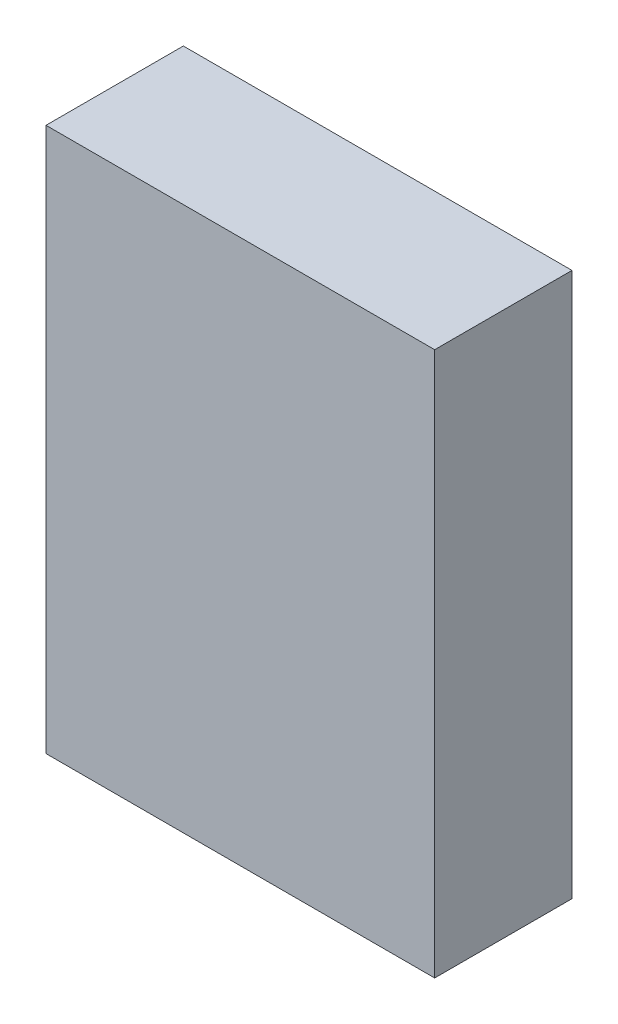
ISO-10303-21;
HEADER;
FILE_DESCRIPTION(('STEP AP214'),'2;1');
FILE_NAME('part.step','',(''),(''),'','','');
FILE_SCHEMA(('AUTOMOTIVE_DESIGN { 1 0 10303 214 1 1 1 1 }'));
ENDSEC;
DATA;
#1=APPLICATION_CONTEXT('core data for automotive mechanical design processes');
#2=APPLICATION_PROTOCOL_DEFINITION('international standard','automotive_design',2000,#1);
#3=PRODUCT_CONTEXT('',#1,'mechanical');
#4=PRODUCT('Part','Part','',(#3));
#5=PRODUCT_RELATED_PRODUCT_CATEGORY('part','',(#4));
#6=PRODUCT_DEFINITION_FORMATION('','',#4);
#7=PRODUCT_DEFINITION_CONTEXT('part definition',#1,'design');
#8=PRODUCT_DEFINITION('design','',#6,#7);
#9=PRODUCT_DEFINITION_SHAPE('','',#8);
#10=(LENGTH_UNIT() NAMED_UNIT(*) SI_UNIT(.MILLI.,.METRE.));
#11=(NAMED_UNIT(*) PLANE_ANGLE_UNIT() SI_UNIT($,.RADIAN.));
#12=(NAMED_UNIT(*) SI_UNIT($,.STERADIAN.) SOLID_ANGLE_UNIT());
#13=UNCERTAINTY_MEASURE_WITH_UNIT(LENGTH_MEASURE(1.E-05),#10,'distance_accuracy_value','');
#14=(GEOMETRIC_REPRESENTATION_CONTEXT(3) GLOBAL_UNCERTAINTY_ASSIGNED_CONTEXT((#13)) GLOBAL_UNIT_ASSIGNED_CONTEXT((#10,
#11,#12)) REPRESENTATION_CONTEXT('',''));
#15=CARTESIAN_POINT('',(0.,0.,0.));
#16=DIRECTION('',(0.,0.,1.));
#17=DIRECTION('',(1.,0.,0.));
#18=AXIS2_PLACEMENT_3D('',#15,#16,#17);
#19=CARTESIAN_POINT('',(-3.75000012,5.24999966,2.64999978));
#20=DIRECTION('',(0.,0.,1.));
#21=DIRECTION('',(1.,0.,0.));
#22=AXIS2_PLACEMENT_3D('',#19,#20,#21);
#23=PLANE('',#22);
#24=DIRECTION('',(0.,1.,0.));
#25=VECTOR('',#24,1.);
#26=CARTESIAN_POINT('',(3.75000012,5.24999966,2.64999978));
#27=LINE('',#26,#25);
#28=CARTESIAN_POINT('',(3.75000012,5.24999966,2.64999978));
#29=VERTEX_POINT('',#28);
#30=CARTESIAN_POINT('',(3.75000012,-5.24999966,2.64999978));
#31=VERTEX_POINT('',#30);
#32=EDGE_CURVE('E53',#29,#31,#27,.F.);
#33=ORIENTED_EDGE('',*,*,#32,.F.);
#34=DIRECTION('',(1.,0.,0.));
#35=VECTOR('',#34,1.);
#36=CARTESIAN_POINT('',(-3.75000012,5.24999966,2.64999978));
#37=LINE('',#36,#35);
#38=CARTESIAN_POINT('',(-3.75000012,5.24999966,2.64999978));
#39=VERTEX_POINT('',#38);
#40=EDGE_CURVE('E68',#39,#29,#37,.T.);
#41=ORIENTED_EDGE('',*,*,#40,.F.);
#42=DIRECTION('',(0.,1.,0.));
#43=VECTOR('',#42,1.);
#44=CARTESIAN_POINT('',(-3.75000012,-5.24999966,2.64999978));
#45=LINE('',#44,#43);
#46=CARTESIAN_POINT('',(-3.75000012,-5.24999966,2.64999978));
#47=VERTEX_POINT('',#46);
#48=EDGE_CURVE('E20',#47,#39,#45,.T.);
#49=ORIENTED_EDGE('',*,*,#48,.F.);
#50=DIRECTION('',(1.,0.,0.));
#51=VECTOR('',#50,1.);
#52=CARTESIAN_POINT('',(3.75000012,-5.24999966,2.64999978));
#53=LINE('',#52,#51);
#54=EDGE_CURVE('E58',#31,#47,#53,.F.);
#55=ORIENTED_EDGE('',*,*,#54,.F.);
#56=EDGE_LOOP('',(#33,#41,#49,#55));
#57=FACE_BOUND('',#56,.T.);
#58=ADVANCED_FACE('F17',(#57),#23,.T.);
#59=CARTESIAN_POINT('',(-3.75000012,-5.24999966,0.));
#60=DIRECTION('',(-1.,0.,0.));
#61=DIRECTION('',(0.,0.,1.));
#62=AXIS2_PLACEMENT_3D('',#59,#60,#61);
#63=PLANE('',#62);
#64=DIRECTION('',(0.,0.,1.));
#65=VECTOR('',#64,1.);
#66=CARTESIAN_POINT('',(-3.75000012,5.24999966,0.));
#67=LINE('',#66,#65);
#68=CARTESIAN_POINT('',(-3.75000012,5.24999966,0.));
#69=VERTEX_POINT('',#68);
#70=EDGE_CURVE('E79',#69,#39,#67,.T.);
#71=ORIENTED_EDGE('',*,*,#70,.F.);
#72=DIRECTION('',(0.,1.,0.));
#73=VECTOR('',#72,1.);
#74=CARTESIAN_POINT('',(-3.75000012,5.24999966,0.));
#75=LINE('',#74,#73);
#76=CARTESIAN_POINT('',(-3.75000012,-5.24999966,0.));
#77=VERTEX_POINT('',#76);
#78=EDGE_CURVE('E74',#69,#77,#75,.F.);
#79=ORIENTED_EDGE('',*,*,#78,.T.);
#80=DIRECTION('',(0.,0.,-1.));
#81=VECTOR('',#80,1.);
#82=CARTESIAN_POINT('',(-3.75000012,-5.24999966,0.));
#83=LINE('',#82,#81);
#84=EDGE_CURVE('E63',#47,#77,#83,.T.);
#85=ORIENTED_EDGE('',*,*,#84,.F.);
#86=ORIENTED_EDGE('',*,*,#48,.T.);
#87=EDGE_LOOP('',(#71,#79,#85,#86));
#88=FACE_BOUND('',#87,.T.);
#89=ADVANCED_FACE('F73',(#88),#63,.T.);
#90=CARTESIAN_POINT('',(3.75000012,-5.24999966,0.));
#91=DIRECTION('',(0.,-1.,0.));
#92=DIRECTION('',(0.,0.,-1.));
#93=AXIS2_PLACEMENT_3D('',#90,#91,#92);
#94=PLANE('',#93);
#95=ORIENTED_EDGE('',*,*,#84,.T.);
#96=DIRECTION('',(1.,0.,0.));
#97=VECTOR('',#96,1.);
#98=CARTESIAN_POINT('',(-3.75000012,-5.24999966,0.));
#99=LINE('',#98,#97);
#100=CARTESIAN_POINT('',(3.75000012,-5.24999966,0.));
#101=VERTEX_POINT('',#100);
#102=EDGE_CURVE('E84',#77,#101,#99,.T.);
#103=ORIENTED_EDGE('',*,*,#102,.T.);
#104=DIRECTION('',(0.,0.,-1.));
#105=VECTOR('',#104,1.);
#106=CARTESIAN_POINT('',(3.75000012,-5.24999966,0.));
#107=LINE('',#106,#105);
#108=EDGE_CURVE('E65',#31,#101,#107,.T.);
#109=ORIENTED_EDGE('',*,*,#108,.F.);
#110=ORIENTED_EDGE('',*,*,#54,.T.);
#111=EDGE_LOOP('',(#95,#103,#109,#110));
#112=FACE_BOUND('',#111,.T.);
#113=ADVANCED_FACE('F60',(#112),#94,.T.);
#114=CARTESIAN_POINT('',(3.75000012,5.24999966,0.));
#115=DIRECTION('',(1.,0.,0.));
#116=DIRECTION('',(0.,0.,-1.));
#117=AXIS2_PLACEMENT_3D('',#114,#115,#116);
#118=PLANE('',#117);
#119=ORIENTED_EDGE('',*,*,#108,.T.);
#120=DIRECTION('',(0.,1.,0.));
#121=VECTOR('',#120,1.);
#122=CARTESIAN_POINT('',(3.75000012,5.24999966,0.));
#123=LINE('',#122,#121);
#124=CARTESIAN_POINT('',(3.75000012,5.24999966,0.));
#125=VERTEX_POINT('',#124);
#126=EDGE_CURVE('E26',#101,#125,#123,.T.);
#127=ORIENTED_EDGE('',*,*,#126,.T.);
#128=DIRECTION('',(0.,0.,1.));
#129=VECTOR('',#128,1.);
#130=CARTESIAN_POINT('',(3.75000012,5.24999966,0.));
#131=LINE('',#130,#129);
#132=EDGE_CURVE('E34',#29,#125,#131,.F.);
#133=ORIENTED_EDGE('',*,*,#132,.F.);
#134=ORIENTED_EDGE('',*,*,#32,.T.);
#135=EDGE_LOOP('',(#119,#127,#133,#134));
#136=FACE_BOUND('',#135,.T.);
#137=ADVANCED_FACE('F88',(#136),#118,.T.);
#138=CARTESIAN_POINT('',(-3.75000012,5.24999966,0.));
#139=DIRECTION('',(0.,1.,0.));
#140=DIRECTION('',(0.,0.,1.));
#141=AXIS2_PLACEMENT_3D('',#138,#139,#140);
#142=PLANE('',#141);
#143=ORIENTED_EDGE('',*,*,#132,.T.);
#144=DIRECTION('',(1.,0.,0.));
#145=VECTOR('',#144,1.);
#146=CARTESIAN_POINT('',(-3.75000012,5.24999966,0.));
#147=LINE('',#146,#145);
#148=EDGE_CURVE('E11',#125,#69,#147,.F.);
#149=ORIENTED_EDGE('',*,*,#148,.T.);
#150=ORIENTED_EDGE('',*,*,#70,.T.);
#151=ORIENTED_EDGE('',*,*,#40,.T.);
#152=EDGE_LOOP('',(#143,#149,#150,#151));
#153=FACE_BOUND('',#152,.T.);
#154=ADVANCED_FACE('F91',(#153),#142,.T.);
#155=CARTESIAN_POINT('',(-3.75000012,5.24999966,0.));
#156=DIRECTION('',(0.,0.,1.));
#157=DIRECTION('',(1.,0.,0.));
#158=AXIS2_PLACEMENT_3D('',#155,#156,#157);
#159=PLANE('',#158);
#160=ORIENTED_EDGE('',*,*,#126,.F.);
#161=ORIENTED_EDGE('',*,*,#102,.F.);
#162=ORIENTED_EDGE('',*,*,#78,.F.);
#163=ORIENTED_EDGE('',*,*,#148,.F.);
#164=EDGE_LOOP('',(#160,#161,#162,#163));
#165=FACE_BOUND('',#164,.T.);
#166=ADVANCED_FACE('F90',(#165),#159,.F.);
#167=CLOSED_SHELL('',(#58,#89,#113,#137,#154,#166));
#168=MANIFOLD_SOLID_BREP('B1',#167);
#169=ADVANCED_BREP_SHAPE_REPRESENTATION('',(#18,#168),#14);
#170=SHAPE_DEFINITION_REPRESENTATION(#9,#169);
ENDSEC;
END-ISO-10303-21;
